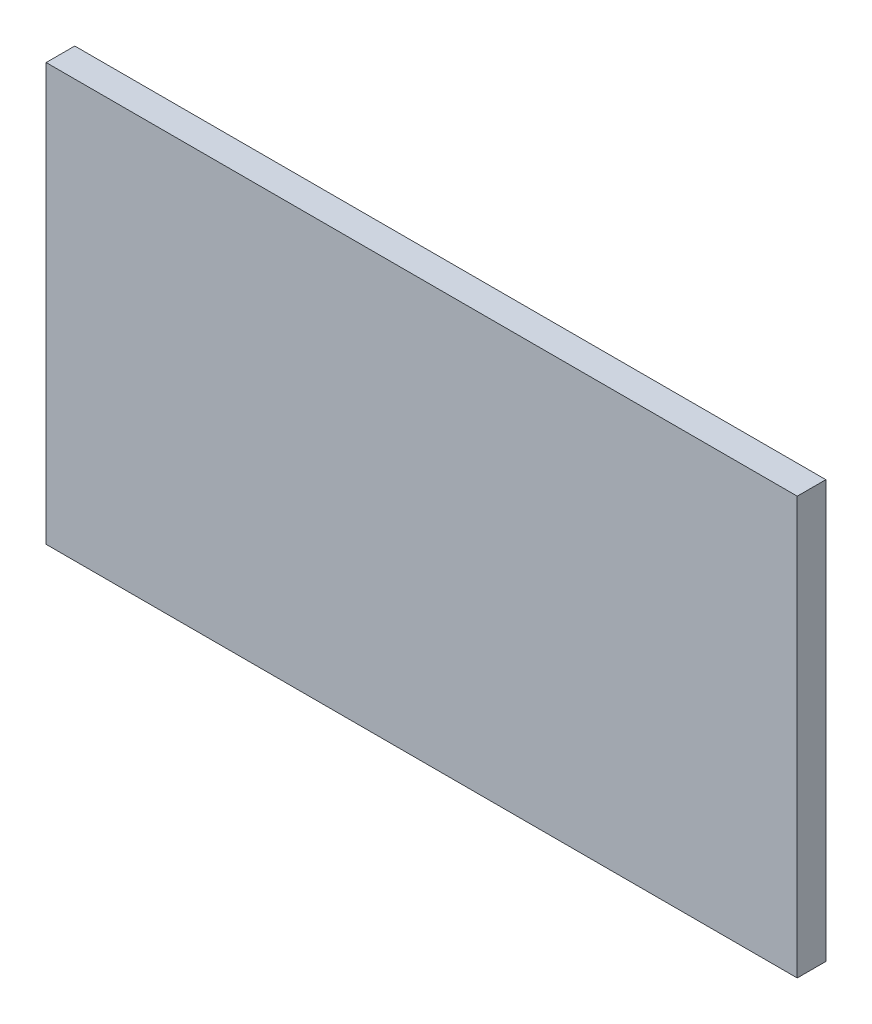
ISO-10303-21;
HEADER;
FILE_DESCRIPTION(('STEP AP214'),'2;1');
FILE_NAME('part.step','',(''),(''),'','','');
FILE_SCHEMA(('AUTOMOTIVE_DESIGN { 1 0 10303 214 1 1 1 1 }'));
ENDSEC;
DATA;
#1=APPLICATION_CONTEXT('core data for automotive mechanical design processes');
#2=APPLICATION_PROTOCOL_DEFINITION('international standard','automotive_design',2000,#1);
#3=PRODUCT_CONTEXT('',#1,'mechanical');
#4=PRODUCT('Part','Part','',(#3));
#5=PRODUCT_RELATED_PRODUCT_CATEGORY('part','',(#4));
#6=PRODUCT_DEFINITION_FORMATION('','',#4);
#7=PRODUCT_DEFINITION_CONTEXT('part definition',#1,'design');
#8=PRODUCT_DEFINITION('design','',#6,#7);
#9=PRODUCT_DEFINITION_SHAPE('','',#8);
#10=(LENGTH_UNIT() NAMED_UNIT(*) SI_UNIT(.MILLI.,.METRE.));
#11=(NAMED_UNIT(*) PLANE_ANGLE_UNIT() SI_UNIT($,.RADIAN.));
#12=(NAMED_UNIT(*) SI_UNIT($,.STERADIAN.) SOLID_ANGLE_UNIT());
#13=UNCERTAINTY_MEASURE_WITH_UNIT(LENGTH_MEASURE(1.E-05),#10,'distance_accuracy_value','');
#14=(GEOMETRIC_REPRESENTATION_CONTEXT(3) GLOBAL_UNCERTAINTY_ASSIGNED_CONTEXT((#13)) GLOBAL_UNIT_ASSIGNED_CONTEXT((#10,
#11,#12)) REPRESENTATION_CONTEXT('',''));
#15=CARTESIAN_POINT('',(0.,0.,0.));
#16=DIRECTION('',(0.,0.,1.));
#17=DIRECTION('',(1.,0.,0.));
#18=AXIS2_PLACEMENT_3D('',#15,#16,#17);
#19=CARTESIAN_POINT('',(0.70008,7.2,0.));
#20=DIRECTION('',(0.,0.,-1.));
#21=DIRECTION('',(-1.,0.,0.));
#22=AXIS2_PLACEMENT_3D('',#19,#20,#21);
#23=PLANE('',#22);
#24=DIRECTION('',(1.,0.,0.));
#25=VECTOR('',#24,1.);
#26=CARTESIAN_POINT('',(0.25008,7.45,0.));
#27=LINE('',#26,#25);
#28=CARTESIAN_POINT('',(0.25008,7.45,0.));
#29=VERTEX_POINT('',#28);
#30=CARTESIAN_POINT('',(1.15008,7.45,0.));
#31=VERTEX_POINT('',#30);
#32=EDGE_CURVE('E55',#29,#31,#27,.T.);
#33=ORIENTED_EDGE('',*,*,#32,.T.);
#34=DIRECTION('',(0.,1.,0.));
#35=VECTOR('',#34,1.);
#36=CARTESIAN_POINT('',(1.15008,7.45,0.));
#37=LINE('',#36,#35);
#38=CARTESIAN_POINT('',(1.15008,6.95,0.));
#39=VERTEX_POINT('',#38);
#40=EDGE_CURVE('E57',#31,#39,#37,.F.);
#41=ORIENTED_EDGE('',*,*,#40,.T.);
#42=DIRECTION('',(1.,0.,0.));
#43=VECTOR('',#42,1.);
#44=CARTESIAN_POINT('',(1.15008,6.95,0.));
#45=LINE('',#44,#43);
#46=CARTESIAN_POINT('',(0.25008,6.95,0.));
#47=VERTEX_POINT('',#46);
#48=EDGE_CURVE('E20',#39,#47,#45,.F.);
#49=ORIENTED_EDGE('',*,*,#48,.T.);
#50=DIRECTION('',(0.,1.,0.));
#51=VECTOR('',#50,1.);
#52=CARTESIAN_POINT('',(0.25008,6.95,0.));
#53=LINE('',#52,#51);
#54=EDGE_CURVE('E80',#47,#29,#53,.T.);
#55=ORIENTED_EDGE('',*,*,#54,.T.);
#56=EDGE_LOOP('',(#33,#41,#49,#55));
#57=FACE_BOUND('',#56,.T.);
#58=ADVANCED_FACE('F17',(#57),#23,.T.);
#59=CARTESIAN_POINT('',(1.15008,6.95,0.));
#60=DIRECTION('',(0.,1.,0.));
#61=DIRECTION('',(0.,0.,1.));
#62=AXIS2_PLACEMENT_3D('',#59,#60,#61);
#63=PLANE('',#62);
#64=DIRECTION('',(0.,0.,-1.));
#65=VECTOR('',#64,1.);
#66=CARTESIAN_POINT('',(0.25008,6.95,0.));
#67=LINE('',#66,#65);
#68=CARTESIAN_POINT('',(0.25008,6.95,0.03429));
#69=VERTEX_POINT('',#68);
#70=EDGE_CURVE('E68',#69,#47,#67,.T.);
#71=ORIENTED_EDGE('',*,*,#70,.T.);
#72=ORIENTED_EDGE('',*,*,#48,.F.);
#73=DIRECTION('',(0.,0.,1.));
#74=VECTOR('',#73,1.);
#75=CARTESIAN_POINT('',(1.15008,6.95,0.));
#76=LINE('',#75,#74);
#77=CARTESIAN_POINT('',(1.15008,6.95,0.03429));
#78=VERTEX_POINT('',#77);
#79=EDGE_CURVE('E63',#39,#78,#76,.T.);
#80=ORIENTED_EDGE('',*,*,#79,.T.);
#81=DIRECTION('',(1.,0.,0.));
#82=VECTOR('',#81,1.);
#83=CARTESIAN_POINT('',(0.70008,6.95,0.03429));
#84=LINE('',#83,#82);
#85=EDGE_CURVE('E83',#69,#78,#84,.T.);
#86=ORIENTED_EDGE('',*,*,#85,.F.);
#87=EDGE_LOOP('',(#71,#72,#80,#86));
#88=FACE_BOUND('',#87,.T.);
#89=ADVANCED_FACE('F65',(#88),#63,.F.);
#90=CARTESIAN_POINT('',(1.15008,7.45,0.));
#91=DIRECTION('',(-1.,0.,0.));
#92=DIRECTION('',(0.,0.,1.));
#93=AXIS2_PLACEMENT_3D('',#90,#91,#92);
#94=PLANE('',#93);
#95=ORIENTED_EDGE('',*,*,#79,.F.);
#96=ORIENTED_EDGE('',*,*,#40,.F.);
#97=DIRECTION('',(0.,0.,-1.));
#98=VECTOR('',#97,1.);
#99=CARTESIAN_POINT('',(1.15008,7.45,0.));
#100=LINE('',#99,#98);
#101=CARTESIAN_POINT('',(1.15008,7.45,0.03429));
#102=VERTEX_POINT('',#101);
#103=EDGE_CURVE('E75',#31,#102,#100,.F.);
#104=ORIENTED_EDGE('',*,*,#103,.T.);
#105=DIRECTION('',(0.,1.,0.));
#106=VECTOR('',#105,1.);
#107=CARTESIAN_POINT('',(1.15008,7.2,0.03429));
#108=LINE('',#107,#106);
#109=EDGE_CURVE('E72',#78,#102,#108,.T.);
#110=ORIENTED_EDGE('',*,*,#109,.F.);
#111=EDGE_LOOP('',(#95,#96,#104,#110));
#112=FACE_BOUND('',#111,.T.);
#113=ADVANCED_FACE('F70',(#112),#94,.F.);
#114=CARTESIAN_POINT('',(0.25008,7.45,0.));
#115=DIRECTION('',(0.,-1.,0.));
#116=DIRECTION('',(0.,0.,-1.));
#117=AXIS2_PLACEMENT_3D('',#114,#115,#116);
#118=PLANE('',#117);
#119=ORIENTED_EDGE('',*,*,#103,.F.);
#120=ORIENTED_EDGE('',*,*,#32,.F.);
#121=DIRECTION('',(0.,0.,-1.));
#122=VECTOR('',#121,1.);
#123=CARTESIAN_POINT('',(0.25008,7.45,0.));
#124=LINE('',#123,#122);
#125=CARTESIAN_POINT('',(0.25008,7.45,0.03429));
#126=VERTEX_POINT('',#125);
#127=EDGE_CURVE('E35',#29,#126,#124,.F.);
#128=ORIENTED_EDGE('',*,*,#127,.T.);
#129=DIRECTION('',(1.,0.,0.));
#130=VECTOR('',#129,1.);
#131=CARTESIAN_POINT('',(0.70008,7.45,0.03429));
#132=LINE('',#131,#130);
#133=EDGE_CURVE('E26',#102,#126,#132,.F.);
#134=ORIENTED_EDGE('',*,*,#133,.F.);
#135=EDGE_LOOP('',(#119,#120,#128,#134));
#136=FACE_BOUND('',#135,.T.);
#137=ADVANCED_FACE('F89',(#136),#118,.F.);
#138=CARTESIAN_POINT('',(0.25008,6.95,0.));
#139=DIRECTION('',(1.,0.,0.));
#140=DIRECTION('',(0.,0.,-1.));
#141=AXIS2_PLACEMENT_3D('',#138,#139,#140);
#142=PLANE('',#141);
#143=ORIENTED_EDGE('',*,*,#127,.F.);
#144=ORIENTED_EDGE('',*,*,#54,.F.);
#145=ORIENTED_EDGE('',*,*,#70,.F.);
#146=DIRECTION('',(0.,1.,0.));
#147=VECTOR('',#146,1.);
#148=CARTESIAN_POINT('',(0.25008,7.2,0.03429));
#149=LINE('',#148,#147);
#150=EDGE_CURVE('E11',#126,#69,#149,.F.);
#151=ORIENTED_EDGE('',*,*,#150,.F.);
#152=EDGE_LOOP('',(#143,#144,#145,#151));
#153=FACE_BOUND('',#152,.T.);
#154=ADVANCED_FACE('F91',(#153),#142,.F.);
#155=CARTESIAN_POINT('',(0.70008,7.2,0.03429));
#156=DIRECTION('',(0.,0.,1.));
#157=DIRECTION('',(1.,0.,0.));
#158=AXIS2_PLACEMENT_3D('',#155,#156,#157);
#159=PLANE('',#158);
#160=ORIENTED_EDGE('',*,*,#133,.T.);
#161=ORIENTED_EDGE('',*,*,#150,.T.);
#162=ORIENTED_EDGE('',*,*,#85,.T.);
#163=ORIENTED_EDGE('',*,*,#109,.T.);
#164=EDGE_LOOP('',(#160,#161,#162,#163));
#165=FACE_BOUND('',#164,.T.);
#166=ADVANCED_FACE('F88',(#165),#159,.T.);
#167=CLOSED_SHELL('',(#58,#89,#113,#137,#154,#166));
#168=MANIFOLD_SOLID_BREP('B1',#167);
#169=ADVANCED_BREP_SHAPE_REPRESENTATION('',(#18,#168),#14);
#170=SHAPE_DEFINITION_REPRESENTATION(#9,#169);
ENDSEC;
END-ISO-10303-21;
